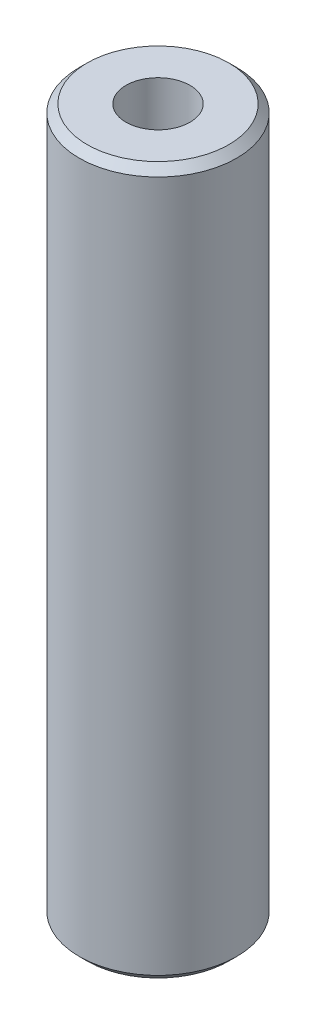
ISO-10303-21;
HEADER;
FILE_DESCRIPTION(('STEP AP214'),'2;1');
FILE_NAME('part.step','',(''),(''),'','','');
FILE_SCHEMA(('AUTOMOTIVE_DESIGN { 1 0 10303 214 1 1 1 1 }'));
ENDSEC;
DATA;
#1=APPLICATION_CONTEXT('core data for automotive mechanical design processes');
#2=APPLICATION_PROTOCOL_DEFINITION('international standard','automotive_design',2000,#1);
#3=PRODUCT_CONTEXT('',#1,'mechanical');
#4=PRODUCT('Part','Part','',(#3));
#5=PRODUCT_RELATED_PRODUCT_CATEGORY('part','',(#4));
#6=PRODUCT_DEFINITION_FORMATION('','',#4);
#7=PRODUCT_DEFINITION_CONTEXT('part definition',#1,'design');
#8=PRODUCT_DEFINITION('design','',#6,#7);
#9=PRODUCT_DEFINITION_SHAPE('','',#8);
#10=(LENGTH_UNIT() NAMED_UNIT(*) SI_UNIT(.MILLI.,.METRE.));
#11=(NAMED_UNIT(*) PLANE_ANGLE_UNIT() SI_UNIT($,.RADIAN.));
#12=(NAMED_UNIT(*) SI_UNIT($,.STERADIAN.) SOLID_ANGLE_UNIT());
#13=UNCERTAINTY_MEASURE_WITH_UNIT(LENGTH_MEASURE(1.E-05),#10,'distance_accuracy_value','');
#14=(GEOMETRIC_REPRESENTATION_CONTEXT(3) GLOBAL_UNCERTAINTY_ASSIGNED_CONTEXT((#13)) GLOBAL_UNIT_ASSIGNED_CONTEXT((#10,
#11,#12)) REPRESENTATION_CONTEXT('',''));
#15=CARTESIAN_POINT('',(0.,0.,0.));
#16=DIRECTION('',(0.,0.,1.));
#17=DIRECTION('',(1.,0.,0.));
#18=AXIS2_PLACEMENT_3D('',#15,#16,#17);
#19=CARTESIAN_POINT('',(0.,539.247639648859,0.));
#20=DIRECTION('',(0.,-1.,0.));
#21=DIRECTION('',(0.,0.,-1.));
#22=AXIS2_PLACEMENT_3D('',#19,#20,#21);
#23=CYLINDRICAL_SURFACE('',#22,60.);
#24=CARTESIAN_POINT('',(0.,533.275773380226,0.));
#25=DIRECTION('',(0.,1.,0.));
#26=DIRECTION('',(0.,0.,1.));
#27=AXIS2_PLACEMENT_3D('',#24,#25,#26);
#28=CIRCLE('',#27,60.);
#29=CARTESIAN_POINT('',(0.,533.275773380226,-60.0000000000001));
#30=VERTEX_POINT('',#29);
#31=EDGE_CURVE('E50',#30,#30,#28,.F.);
#32=ORIENTED_EDGE('',*,*,#31,.T.);
#33=EDGE_LOOP('',(#32));
#34=FACE_BOUND('',#33,.T.);
#35=CARTESIAN_POINT('',(0.,5.97186626863311,0.));
#36=DIRECTION('',(0.,1.,0.));
#37=DIRECTION('',(0.,0.,1.));
#38=AXIS2_PLACEMENT_3D('',#35,#36,#37);
#39=CIRCLE('',#38,60.);
#40=CARTESIAN_POINT('',(0.,5.97186626863311,60.));
#41=VERTEX_POINT('',#40);
#42=EDGE_CURVE('E51',#41,#41,#39,.T.);
#43=ORIENTED_EDGE('',*,*,#42,.T.);
#44=EDGE_LOOP('',(#43));
#45=FACE_BOUND('',#44,.T.);
#46=ADVANCED_FACE('F39',(#34,#45),#23,.T.);
#47=CARTESIAN_POINT('',(0.,539.247639648859,0.));
#48=DIRECTION('',(0.,1.,0.));
#49=DIRECTION('',(0.,0.,1.));
#50=AXIS2_PLACEMENT_3D('',#47,#48,#49);
#51=PLANE('',#50);
#52=CARTESIAN_POINT('',(0.,539.247639648859,0.));
#53=DIRECTION('',(0.,1.,0.));
#54=DIRECTION('',(0.,0.,1.));
#55=AXIS2_PLACEMENT_3D('',#52,#53,#54);
#56=CIRCLE('',#55,54.0281337313668);
#57=CARTESIAN_POINT('',(0.,539.247639648859,-54.0281337313668));
#58=VERTEX_POINT('',#57);
#59=EDGE_CURVE('E54',#58,#58,#56,.T.);
#60=ORIENTED_EDGE('',*,*,#59,.T.);
#61=EDGE_LOOP('',(#60));
#62=FACE_BOUND('',#61,.T.);
#63=CARTESIAN_POINT('',(0.,539.247639648859,0.));
#64=DIRECTION('',(0.,1.,0.));
#65=DIRECTION('',(0.,0.,1.));
#66=AXIS2_PLACEMENT_3D('',#63,#64,#65);
#67=CIRCLE('',#66,24.4000570059614);
#68=CARTESIAN_POINT('',(0.,539.247639648859,24.4000570059614));
#69=VERTEX_POINT('',#68);
#70=EDGE_CURVE('E58',#69,#69,#67,.T.);
#71=ORIENTED_EDGE('',*,*,#70,.F.);
#72=EDGE_LOOP('',(#71));
#73=FACE_BOUND('',#72,.T.);
#74=ADVANCED_FACE('F69',(#62,#73),#51,.T.);
#75=CARTESIAN_POINT('',(0.,0.,0.));
#76=DIRECTION('',(0.,1.,0.));
#77=DIRECTION('',(0.,0.,1.));
#78=AXIS2_PLACEMENT_3D('',#75,#76,#77);
#79=PLANE('',#78);
#80=CARTESIAN_POINT('',(0.,0.,0.));
#81=DIRECTION('',(0.,1.,0.));
#82=DIRECTION('',(0.,0.,1.));
#83=AXIS2_PLACEMENT_3D('',#80,#81,#82);
#84=CIRCLE('',#83,54.0281337313668);
#85=CARTESIAN_POINT('',(0.,0.,54.0281337313668));
#86=VERTEX_POINT('',#85);
#87=EDGE_CURVE('E10',#86,#86,#84,.F.);
#88=ORIENTED_EDGE('',*,*,#87,.T.);
#89=EDGE_LOOP('',(#88));
#90=FACE_BOUND('',#89,.T.);
#91=CARTESIAN_POINT('',(0.,0.,0.));
#92=DIRECTION('',(0.,1.,0.));
#93=DIRECTION('',(0.,0.,1.));
#94=AXIS2_PLACEMENT_3D('',#91,#92,#93);
#95=CIRCLE('',#94,24.4000570059614);
#96=CARTESIAN_POINT('',(0.,0.,24.4000570059614));
#97=VERTEX_POINT('',#96);
#98=EDGE_CURVE('E63',#97,#97,#95,.T.);
#99=ORIENTED_EDGE('',*,*,#98,.T.);
#100=EDGE_LOOP('',(#99));
#101=FACE_BOUND('',#100,.T.);
#102=ADVANCED_FACE('F75',(#90,#101),#79,.F.);
#103=CARTESIAN_POINT('',(0.,539.247639648859,0.));
#104=DIRECTION('',(0.,-1.,0.));
#105=DIRECTION('',(0.,0.,-1.));
#106=AXIS2_PLACEMENT_3D('',#103,#104,#105);
#107=CYLINDRICAL_SURFACE('',#106,24.4000570059614);
#108=ORIENTED_EDGE('',*,*,#70,.T.);
#109=EDGE_LOOP('',(#108));
#110=FACE_BOUND('',#109,.T.);
#111=ORIENTED_EDGE('',*,*,#98,.F.);
#112=EDGE_LOOP('',(#111));
#113=FACE_BOUND('',#112,.T.);
#114=ADVANCED_FACE('F70',(#110,#113),#107,.F.);
#115=CARTESIAN_POINT('',(0.,539.247639648859,0.));
#116=DIRECTION('',(0.,-1.,0.));
#117=DIRECTION('',(0.,0.,-1.));
#118=AXIS2_PLACEMENT_3D('',#115,#116,#117);
#119=CONICAL_SURFACE('',#118,54.0281337313668,0.785398163397448);
#120=CARTESIAN_POINT('',(0.,533.275773380226,-60.0000000000001));
#121=CARTESIAN_POINT('',(0.,533.337980320524,-59.9377930597018));
#122=CARTESIAN_POINT('',(0.,533.400187260822,-59.8755861194035));
#123=CARTESIAN_POINT('',(0.,533.524601141419,-59.751172238807));
#124=CARTESIAN_POINT('',(0.,533.586808081717,-59.6889652985087));
#125=CARTESIAN_POINT('',(0.,533.711221962314,-59.5645514179122));
#126=CARTESIAN_POINT('',(0.,533.773428902612,-59.502344477614));
#127=CARTESIAN_POINT('',(0.,533.897842783208,-59.3779305970174));
#128=CARTESIAN_POINT('',(0.,533.960049723507,-59.3157236567192));
#129=CARTESIAN_POINT('',(0.,534.084463604103,-59.1913097761226));
#130=CARTESIAN_POINT('',(0.,534.146670544402,-59.1291028358244));
#131=CARTESIAN_POINT('',(0.,534.271084424998,-59.0046889552279));
#132=CARTESIAN_POINT('',(0.,534.333291365296,-58.9424820149296));
#133=CARTESIAN_POINT('',(0.,534.457705245893,-58.8180681343331));
#134=CARTESIAN_POINT('',(0.,534.519912186191,-58.7558611940348));
#135=CARTESIAN_POINT('',(0.,534.644326066788,-58.6314473134383));
#136=CARTESIAN_POINT('',(0.,534.706533007086,-58.56924037314));
#137=CARTESIAN_POINT('',(0.,534.830946887682,-58.4448264925435));
#138=CARTESIAN_POINT('',(0.,534.893153827981,-58.3826195522452));
#139=CARTESIAN_POINT('',(0.,535.017567708577,-58.2582056716487));
#140=CARTESIAN_POINT('',(0.,535.079774648876,-58.1959987313504));
#141=CARTESIAN_POINT('',(0.,535.204188529472,-58.0715848507539));
#142=CARTESIAN_POINT('',(0.,535.26639546977,-58.0093779104556));
#143=CARTESIAN_POINT('',(0.,535.390809350367,-57.8849640298591));
#144=CARTESIAN_POINT('',(0.,535.453016290665,-57.8227570895609));
#145=CARTESIAN_POINT('',(0.,535.577430171262,-57.6983432089643));
#146=CARTESIAN_POINT('',(0.,535.63963711156,-57.6361362686661));
#147=CARTESIAN_POINT('',(0.,535.764050992156,-57.5117223880695));
#148=CARTESIAN_POINT('',(0.,535.826257932455,-57.4495154477713));
#149=CARTESIAN_POINT('',(0.,535.950671813051,-57.3251015671748));
#150=CARTESIAN_POINT('',(0.,536.012878753349,-57.2628946268765));
#151=CARTESIAN_POINT('',(0.,536.137292633946,-57.13848074628));
#152=CARTESIAN_POINT('',(0.,536.199499574244,-57.0762738059817));
#153=CARTESIAN_POINT('',(0.,536.323913454841,-56.9518599253852));
#154=CARTESIAN_POINT('',(0.,536.386120395139,-56.8896529850869));
#155=CARTESIAN_POINT('',(0.,536.510534275735,-56.7652391044904));
#156=CARTESIAN_POINT('',(0.,536.572741216034,-56.7030321641921));
#157=CARTESIAN_POINT('',(0.,536.69715509663,-56.5786182835956));
#158=CARTESIAN_POINT('',(0.,536.759362036929,-56.5164113432973));
#159=CARTESIAN_POINT('',(0.,536.883775917525,-56.3919974627008));
#160=CARTESIAN_POINT('',(0.,536.945982857823,-56.3297905224025));
#161=CARTESIAN_POINT('',(0.,537.07039673842,-56.205376641806));
#162=CARTESIAN_POINT('',(0.,537.132603678718,-56.1431697015078));
#163=CARTESIAN_POINT('',(0.,537.257017559315,-56.0187558209112));
#164=CARTESIAN_POINT('',(0.,537.319224499613,-55.956548880613));
#165=CARTESIAN_POINT('',(0.,537.443638380209,-55.8321350000165));
#166=CARTESIAN_POINT('',(0.,537.505845320508,-55.7699280597182));
#167=CARTESIAN_POINT('',(0.,537.630259201104,-55.6455141791217));
#168=CARTESIAN_POINT('',(0.,537.692466141403,-55.5833072388234));
#169=CARTESIAN_POINT('',(0.,537.816880021999,-55.4588933582269));
#170=CARTESIAN_POINT('',(0.,537.879086962297,-55.3966864179286));
#171=CARTESIAN_POINT('',(0.,538.003500842894,-55.2722725373321));
#172=CARTESIAN_POINT('',(0.,538.065707783192,-55.2100655970338));
#173=CARTESIAN_POINT('',(0.,538.190121663789,-55.0856517164373));
#174=CARTESIAN_POINT('',(0.,538.252328604087,-55.023444776139));
#175=CARTESIAN_POINT('',(0.,538.376742484683,-54.8990308955425));
#176=CARTESIAN_POINT('',(0.,538.438949424982,-54.8368239552443));
#177=CARTESIAN_POINT('',(0.,538.563363305578,-54.7124100746477));
#178=CARTESIAN_POINT('',(0.,538.625570245876,-54.6502031343495));
#179=CARTESIAN_POINT('',(0.,538.749984126473,-54.5257892537529));
#180=CARTESIAN_POINT('',(0.,538.812191066771,-54.4635823134547));
#181=CARTESIAN_POINT('',(0.,538.936604947368,-54.3391684328582));
#182=CARTESIAN_POINT('',(0.,538.998811887666,-54.2769614925599));
#183=CARTESIAN_POINT('',(0.,539.123225768263,-54.1525476119634));
#184=CARTESIAN_POINT('',(0.,539.185432708561,-54.0903406716651));
#185=CARTESIAN_POINT('',(0.,539.247639648859,-54.0281337313668));
#186=B_SPLINE_CURVE_WITH_KNOTS('',3,(#120,#121,#122,#123,#124,#125,#126,#127,#128,#129,#130,
#131,#132,#133,#134,#135,#136,#137,#138,#139,#140,#141,#142,#143,#144,#145,#146,#147,#148,#149,
#150,#151,#152,#153,#154,#155,#156,#157,#158,#159,#160,#161,#162,#163,#164,#165,#166,#167,#168,
#169,#170,#171,#172,#173,#174,#175,#176,#177,#178,#179,#180,#181,#182,#183,#184,#185),
.UNSPECIFIED.,.F.,.F.,(4,2,2,2,2,2,2,2,2,2,2,2,2,2,2,2,2,2,2,2,2,2,2,2,2,2,2,2,2,2,2,2,4),(0.,
0.263921695930556,0.52784339186119,0.791765087791824,1.05568678372238,1.31960847965301,
1.58353017558365,1.8474518715142,2.11137356744484,2.37529526337547,2.63921695930603,
2.90313865523666,3.1670603511673,3.43098204709785,3.69490374302849,3.95882543895912,
4.22274713488975,4.48666883082031,4.75059052675094,5.01451222268158,5.27843391861213,
5.54235561454277,5.8062773104734,6.07019900640395,6.33412070233459,6.59804239826522,
6.86196409419578,7.12588579012641,7.38980748605705,7.6537291819876,7.91765087791824,
8.18157257384887,8.4454942697795),.UNSPECIFIED.);
#187=EDGE_CURVE('BSEAM81',#30,#58,#186,.T.);
#188=ORIENTED_EDGE('',*,*,#31,.F.);
#189=ORIENTED_EDGE('',*,*,#59,.F.);
#190=ORIENTED_EDGE('',*,*,#187,.T.);
#191=ORIENTED_EDGE('',*,*,#187,.F.);
#192=EDGE_LOOP('',(#188,#190,#189,#191));
#193=FACE_BOUND('',#192,.T.);
#194=ADVANCED_FACE('F81',(#193),#119,.T.);
#195=CARTESIAN_POINT('',(0.,5.97186626863311,0.));
#196=DIRECTION('',(0.,1.,0.));
#197=DIRECTION('',(0.,0.,1.));
#198=AXIS2_PLACEMENT_3D('',#195,#196,#197);
#199=CONICAL_SURFACE('',#198,60.,0.785398163397458);
#200=ORIENTED_EDGE('',*,*,#87,.F.);
#201=EDGE_LOOP('',(#200));
#202=FACE_BOUND('',#201,.T.);
#203=ORIENTED_EDGE('',*,*,#42,.F.);
#204=EDGE_LOOP('',(#203));
#205=FACE_BOUND('',#204,.T.);
#206=ADVANCED_FACE('F45',(#202,#205),#199,.T.);
#207=CLOSED_SHELL('',(#46,#74,#102,#114,#194,#206));
#208=MANIFOLD_SOLID_BREP('B2',#207);
#209=ADVANCED_BREP_SHAPE_REPRESENTATION('',(#18,#208),#14);
#210=SHAPE_DEFINITION_REPRESENTATION(#9,#209);
ENDSEC;
END-ISO-10303-21;
